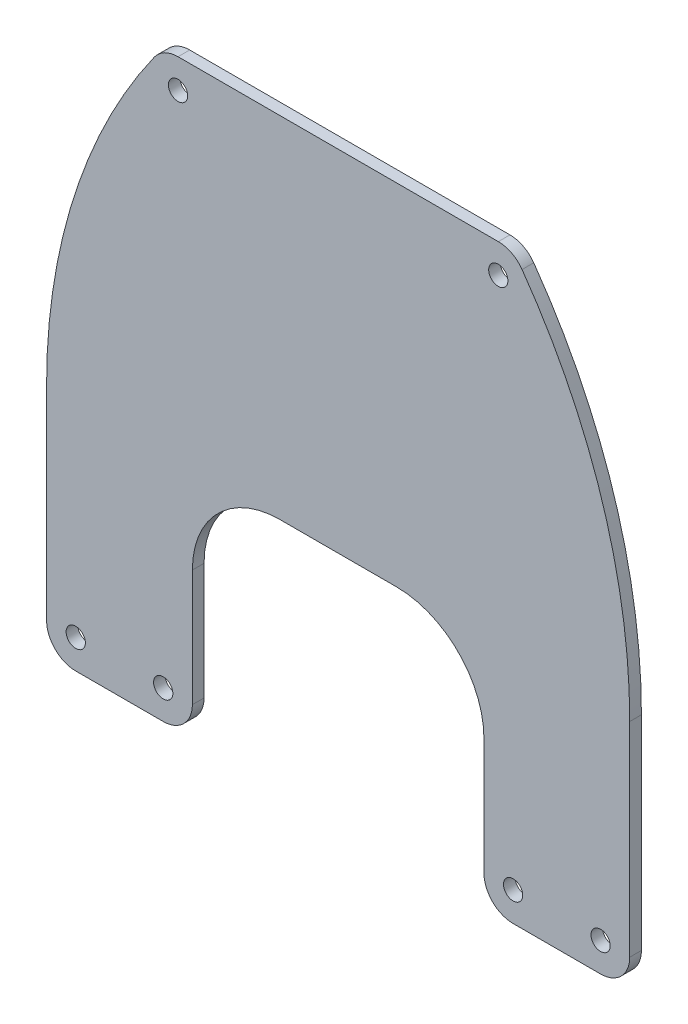
ISO-10303-21;
HEADER;
FILE_DESCRIPTION(('STEP AP214'),'2;1');
FILE_NAME('part.step','',(''),(''),'','','');
FILE_SCHEMA(('AUTOMOTIVE_DESIGN { 1 0 10303 214 1 1 1 1 }'));
ENDSEC;
DATA;
#1=APPLICATION_CONTEXT('core data for automotive mechanical design processes');
#2=APPLICATION_PROTOCOL_DEFINITION('international standard','automotive_design',2000,#1);
#3=PRODUCT_CONTEXT('',#1,'mechanical');
#4=PRODUCT('Part','Part','',(#3));
#5=PRODUCT_RELATED_PRODUCT_CATEGORY('part','',(#4));
#6=PRODUCT_DEFINITION_FORMATION('','',#4);
#7=PRODUCT_DEFINITION_CONTEXT('part definition',#1,'design');
#8=PRODUCT_DEFINITION('design','',#6,#7);
#9=PRODUCT_DEFINITION_SHAPE('','',#8);
#10=(LENGTH_UNIT() NAMED_UNIT(*) SI_UNIT(.MILLI.,.METRE.));
#11=(NAMED_UNIT(*) PLANE_ANGLE_UNIT() SI_UNIT($,.RADIAN.));
#12=(NAMED_UNIT(*) SI_UNIT($,.STERADIAN.) SOLID_ANGLE_UNIT());
#13=UNCERTAINTY_MEASURE_WITH_UNIT(LENGTH_MEASURE(1.E-05),#10,'distance_accuracy_value','');
#14=(GEOMETRIC_REPRESENTATION_CONTEXT(3) GLOBAL_UNCERTAINTY_ASSIGNED_CONTEXT((#13)) GLOBAL_UNIT_ASSIGNED_CONTEXT((#10,
#11,#12)) REPRESENTATION_CONTEXT('',''));
#15=CARTESIAN_POINT('',(0.,0.,0.));
#16=DIRECTION('',(0.,0.,1.));
#17=DIRECTION('',(1.,0.,0.));
#18=AXIS2_PLACEMENT_3D('',#15,#16,#17);
#19=CARTESIAN_POINT('',(0.,40.,2.));
#20=DIRECTION('',(0.,1.,0.));
#21=DIRECTION('',(0.,0.,1.));
#22=AXIS2_PLACEMENT_3D('',#19,#20,#21);
#23=PLANE('',#22);
#24=DIRECTION('',(1.,0.,0.));
#25=VECTOR('',#24,1.);
#26=CARTESIAN_POINT('',(0.,40.,0.));
#27=LINE('',#26,#25);
#28=CARTESIAN_POINT('',(-60.,40.,0.));
#29=VERTEX_POINT('',#28);
#30=CARTESIAN_POINT('',(-40.,40.,0.));
#31=VERTEX_POINT('',#30);
#32=EDGE_CURVE('E200',#29,#31,#27,.T.);
#33=ORIENTED_EDGE('',*,*,#32,.T.);
#34=DIRECTION('',(0.,0.,-1.));
#35=VECTOR('',#34,1.);
#36=CARTESIAN_POINT('',(-40.,40.,2.));
#37=LINE('',#36,#35);
#38=CARTESIAN_POINT('',(-40.,40.,2.));
#39=VERTEX_POINT('',#38);
#40=EDGE_CURVE('E235',#31,#39,#37,.F.);
#41=ORIENTED_EDGE('',*,*,#40,.T.);
#42=DIRECTION('',(1.,0.,0.));
#43=VECTOR('',#42,1.);
#44=CARTESIAN_POINT('',(0.,40.,2.));
#45=LINE('',#44,#43);
#46=CARTESIAN_POINT('',(-60.,40.,2.));
#47=VERTEX_POINT('',#46);
#48=EDGE_CURVE('E227',#47,#39,#45,.T.);
#49=ORIENTED_EDGE('',*,*,#48,.F.);
#50=DIRECTION('',(0.,0.,-1.));
#51=VECTOR('',#50,1.);
#52=CARTESIAN_POINT('',(-60.,40.,2.));
#53=LINE('',#52,#51);
#54=EDGE_CURVE('E232',#47,#29,#53,.T.);
#55=ORIENTED_EDGE('',*,*,#54,.T.);
#56=EDGE_LOOP('',(#33,#41,#49,#55));
#57=FACE_BOUND('',#56,.T.);
#58=ADVANCED_FACE('F35',(#57),#23,.F.);
#59=CARTESIAN_POINT('',(-25.,0.,2.));
#60=DIRECTION('',(1.,0.,0.));
#61=DIRECTION('',(0.,1.,0.));
#62=AXIS2_PLACEMENT_3D('',#59,#60,#61);
#63=PLANE('',#62);
#64=DIRECTION('',(0.,-1.,0.));
#65=VECTOR('',#64,1.);
#66=CARTESIAN_POINT('',(-25.,0.,0.));
#67=LINE('',#66,#65);
#68=CARTESIAN_POINT('',(-25.,25.,0.));
#69=VERTEX_POINT('',#68);
#70=CARTESIAN_POINT('',(-25.,5.,0.));
#71=VERTEX_POINT('',#70);
#72=EDGE_CURVE('E203',#69,#71,#67,.T.);
#73=ORIENTED_EDGE('',*,*,#72,.T.);
#74=DIRECTION('',(0.,0.,-1.));
#75=VECTOR('',#74,1.);
#76=CARTESIAN_POINT('',(-25.,5.,2.));
#77=LINE('',#76,#75);
#78=CARTESIAN_POINT('',(-25.,5.,2.));
#79=VERTEX_POINT('',#78);
#80=EDGE_CURVE('E279',#71,#79,#77,.F.);
#81=ORIENTED_EDGE('',*,*,#80,.T.);
#82=DIRECTION('',(0.,-1.,0.));
#83=VECTOR('',#82,1.);
#84=CARTESIAN_POINT('',(-25.,0.,2.));
#85=LINE('',#84,#83);
#86=CARTESIAN_POINT('',(-25.,25.,2.));
#87=VERTEX_POINT('',#86);
#88=EDGE_CURVE('E349',#87,#79,#85,.T.);
#89=ORIENTED_EDGE('',*,*,#88,.F.);
#90=DIRECTION('',(0.,0.,-1.));
#91=VECTOR('',#90,1.);
#92=CARTESIAN_POINT('',(-25.,25.,0.));
#93=LINE('',#92,#91);
#94=EDGE_CURVE('E181',#87,#69,#93,.T.);
#95=ORIENTED_EDGE('',*,*,#94,.T.);
#96=EDGE_LOOP('',(#73,#81,#89,#95));
#97=FACE_BOUND('',#96,.T.);
#98=ADVANCED_FACE('F346',(#97),#63,.F.);
#99=CARTESIAN_POINT('',(0.,0.,2.));
#100=DIRECTION('',(0.,-1.,0.));
#101=DIRECTION('',(1.,0.,0.));
#102=AXIS2_PLACEMENT_3D('',#99,#100,#101);
#103=PLANE('',#102);
#104=DIRECTION('',(-1.,0.,0.));
#105=VECTOR('',#104,1.);
#106=CARTESIAN_POINT('',(0.,0.,0.));
#107=LINE('',#106,#105);
#108=CARTESIAN_POINT('',(-5.,0.,0.));
#109=VERTEX_POINT('',#108);
#110=CARTESIAN_POINT('',(-20.,0.,0.));
#111=VERTEX_POINT('',#110);
#112=EDGE_CURVE('E207',#109,#111,#107,.T.);
#113=ORIENTED_EDGE('',*,*,#112,.F.);
#114=DIRECTION('',(0.,0.,-1.));
#115=VECTOR('',#114,1.);
#116=CARTESIAN_POINT('',(-5.,0.,2.));
#117=LINE('',#116,#115);
#118=CARTESIAN_POINT('',(-5.,0.,2.));
#119=VERTEX_POINT('',#118);
#120=EDGE_CURVE('E260',#109,#119,#117,.F.);
#121=ORIENTED_EDGE('',*,*,#120,.T.);
#122=DIRECTION('',(-1.,0.,0.));
#123=VECTOR('',#122,1.);
#124=CARTESIAN_POINT('',(0.,0.,2.));
#125=LINE('',#124,#123);
#126=CARTESIAN_POINT('',(-20.,0.,2.));
#127=VERTEX_POINT('',#126);
#128=EDGE_CURVE('E173',#119,#127,#125,.T.);
#129=ORIENTED_EDGE('',*,*,#128,.T.);
#130=DIRECTION('',(0.,0.,-1.));
#131=VECTOR('',#130,1.);
#132=CARTESIAN_POINT('',(-20.,0.,0.));
#133=LINE('',#132,#131);
#134=EDGE_CURVE('E257',#127,#111,#133,.T.);
#135=ORIENTED_EDGE('',*,*,#134,.T.);
#136=EDGE_LOOP('',(#113,#121,#129,#135));
#137=FACE_BOUND('',#136,.T.);
#138=ADVANCED_FACE('F419',(#137),#103,.T.);
#139=CARTESIAN_POINT('',(0.,0.,2.));
#140=DIRECTION('',(-1.,0.,0.));
#141=DIRECTION('',(0.,0.,1.));
#142=AXIS2_PLACEMENT_3D('',#139,#140,#141);
#143=PLANE('',#142);
#144=DIRECTION('',(0.,1.,0.));
#145=VECTOR('',#144,1.);
#146=CARTESIAN_POINT('',(0.,0.,2.));
#147=LINE('',#146,#145);
#148=CARTESIAN_POINT('',(0.,5.,2.));
#149=VERTEX_POINT('',#148);
#150=CARTESIAN_POINT('',(0.,40.,2.));
#151=VERTEX_POINT('',#150);
#152=EDGE_CURVE('E162',#149,#151,#147,.T.);
#153=ORIENTED_EDGE('',*,*,#152,.F.);
#154=DIRECTION('',(0.,0.,-1.));
#155=VECTOR('',#154,1.);
#156=CARTESIAN_POINT('',(0.,5.,0.));
#157=LINE('',#156,#155);
#158=CARTESIAN_POINT('',(0.,5.,0.));
#159=VERTEX_POINT('',#158);
#160=EDGE_CURVE('E247',#149,#159,#157,.T.);
#161=ORIENTED_EDGE('',*,*,#160,.T.);
#162=DIRECTION('',(0.,1.,0.));
#163=VECTOR('',#162,1.);
#164=CARTESIAN_POINT('',(0.,0.,0.));
#165=LINE('',#164,#163);
#166=CARTESIAN_POINT('',(0.,40.,0.));
#167=VERTEX_POINT('',#166);
#168=EDGE_CURVE('E179',#159,#167,#165,.T.);
#169=ORIENTED_EDGE('',*,*,#168,.T.);
#170=DIRECTION('',(0.,0.,-1.));
#171=VECTOR('',#170,1.);
#172=CARTESIAN_POINT('',(0.,40.,2.));
#173=LINE('',#172,#171);
#174=EDGE_CURVE('E176',#151,#167,#173,.T.);
#175=ORIENTED_EDGE('',*,*,#174,.F.);
#176=EDGE_LOOP('',(#153,#161,#169,#175));
#177=FACE_BOUND('',#176,.T.);
#178=ADVANCED_FACE('F177',(#177),#143,.F.);
#179=CARTESIAN_POINT('',(-100.,40.,2.));
#180=DIRECTION('',(0.,0.,-1.));
#181=DIRECTION('',(-1.,0.,0.));
#182=AXIS2_PLACEMENT_3D('',#179,#180,#181);
#183=CYLINDRICAL_SURFACE('',#182,100.);
#184=CARTESIAN_POINT('',(-100.,40.,0.));
#185=DIRECTION('',(0.,0.,1.));
#186=DIRECTION('',(1.,0.,0.));
#187=AXIS2_PLACEMENT_3D('',#184,#185,#186);
#188=CIRCLE('',#187,100.);
#189=CARTESIAN_POINT('',(-18.4635085008965,97.8947368421053,0.));
#190=VERTEX_POINT('',#189);
#191=EDGE_CURVE('E211',#167,#190,#188,.T.);
#192=ORIENTED_EDGE('',*,*,#191,.T.);
#193=DIRECTION('',(0.,0.,-1.));
#194=VECTOR('',#193,1.);
#195=CARTESIAN_POINT('',(-18.4635085008965,97.8947368421053,2.));
#196=LINE('',#195,#194);
#197=CARTESIAN_POINT('',(-18.4635085008965,97.8947368421053,2.));
#198=VERTEX_POINT('',#197);
#199=EDGE_CURVE('E58',#190,#198,#196,.F.);
#200=ORIENTED_EDGE('',*,*,#199,.T.);
#201=CARTESIAN_POINT('',(-100.,40.,2.));
#202=DIRECTION('',(0.,0.,1.));
#203=DIRECTION('',(1.,0.,0.));
#204=AXIS2_PLACEMENT_3D('',#201,#202,#203);
#205=CIRCLE('',#204,100.);
#206=EDGE_CURVE('E165',#151,#198,#205,.T.);
#207=ORIENTED_EDGE('',*,*,#206,.F.);
#208=ORIENTED_EDGE('',*,*,#174,.T.);
#209=EDGE_LOOP('',(#192,#200,#207,#208));
#210=FACE_BOUND('',#209,.T.);
#211=ADVANCED_FACE('F184',(#210),#183,.T.);
#212=CARTESIAN_POINT('',(0.,100.,2.));
#213=DIRECTION('',(0.,-1.,0.));
#214=DIRECTION('',(1.,0.,0.));
#215=AXIS2_PLACEMENT_3D('',#212,#213,#214);
#216=PLANE('',#215);
#217=DIRECTION('',(-1.,0.,0.));
#218=VECTOR('',#217,1.);
#219=CARTESIAN_POINT('',(0.,100.,2.));
#220=LINE('',#219,#218);
#221=CARTESIAN_POINT('',(-22.5403330758517,100.,2.));
#222=VERTEX_POINT('',#221);
#223=CARTESIAN_POINT('',(-77.4596669241483,100.,2.));
#224=VERTEX_POINT('',#223);
#225=EDGE_CURVE('E185',#222,#224,#220,.T.);
#226=ORIENTED_EDGE('',*,*,#225,.F.);
#227=DIRECTION('',(0.,0.,-1.));
#228=VECTOR('',#227,1.);
#229=CARTESIAN_POINT('',(-22.5403330758517,100.,2.));
#230=LINE('',#229,#228);
#231=CARTESIAN_POINT('',(-22.5403330758517,100.,0.));
#232=VERTEX_POINT('',#231);
#233=EDGE_CURVE('E283',#222,#232,#230,.T.);
#234=ORIENTED_EDGE('',*,*,#233,.T.);
#235=DIRECTION('',(-1.,0.,0.));
#236=VECTOR('',#235,1.);
#237=CARTESIAN_POINT('',(0.,100.,0.));
#238=LINE('',#237,#236);
#239=CARTESIAN_POINT('',(-77.4596669241483,100.,0.));
#240=VERTEX_POINT('',#239);
#241=EDGE_CURVE('E213',#232,#240,#238,.T.);
#242=ORIENTED_EDGE('',*,*,#241,.T.);
#243=DIRECTION('',(0.,0.,1.));
#244=VECTOR('',#243,1.);
#245=CARTESIAN_POINT('',(-77.4596669241483,100.,2.));
#246=LINE('',#245,#244);
#247=EDGE_CURVE('E281',#240,#224,#246,.T.);
#248=ORIENTED_EDGE('',*,*,#247,.T.);
#249=EDGE_LOOP('',(#226,#234,#242,#248));
#250=FACE_BOUND('',#249,.T.);
#251=ADVANCED_FACE('F295',(#250),#216,.F.);
#252=CARTESIAN_POINT('',(0.,40.,2.));
#253=DIRECTION('',(0.,0.,-1.));
#254=DIRECTION('',(-1.,0.,0.));
#255=AXIS2_PLACEMENT_3D('',#252,#253,#254);
#256=CYLINDRICAL_SURFACE('',#255,100.);
#257=CARTESIAN_POINT('',(0.,40.,2.));
#258=DIRECTION('',(0.,0.,1.));
#259=DIRECTION('',(1.,0.,0.));
#260=AXIS2_PLACEMENT_3D('',#257,#258,#259);
#261=CIRCLE('',#260,100.);
#262=CARTESIAN_POINT('',(-100.,40.,2.));
#263=VERTEX_POINT('',#262);
#264=CARTESIAN_POINT('',(-81.5364914991035,97.8947368421053,2.));
#265=VERTEX_POINT('',#264);
#266=EDGE_CURVE('E187',#263,#265,#261,.F.);
#267=ORIENTED_EDGE('',*,*,#266,.T.);
#268=DIRECTION('',(0.,0.,-1.));
#269=VECTOR('',#268,1.);
#270=CARTESIAN_POINT('',(-81.5364914991035,97.8947368421053,2.));
#271=LINE('',#270,#269);
#272=CARTESIAN_POINT('',(-81.5364914991035,97.8947368421053,0.));
#273=VERTEX_POINT('',#272);
#274=EDGE_CURVE('E11',#265,#273,#271,.T.);
#275=ORIENTED_EDGE('',*,*,#274,.T.);
#276=CARTESIAN_POINT('',(0.,40.,0.));
#277=DIRECTION('',(0.,0.,1.));
#278=DIRECTION('',(1.,0.,0.));
#279=AXIS2_PLACEMENT_3D('',#276,#277,#278);
#280=CIRCLE('',#279,100.);
#281=CARTESIAN_POINT('',(-100.,40.,0.));
#282=VERTEX_POINT('',#281);
#283=EDGE_CURVE('E216',#282,#273,#280,.F.);
#284=ORIENTED_EDGE('',*,*,#283,.F.);
#285=DIRECTION('',(0.,0.,-1.));
#286=VECTOR('',#285,1.);
#287=CARTESIAN_POINT('',(-100.,40.,2.));
#288=LINE('',#287,#286);
#289=EDGE_CURVE('E182',#263,#282,#288,.T.);
#290=ORIENTED_EDGE('',*,*,#289,.F.);
#291=EDGE_LOOP('',(#267,#275,#284,#290));
#292=FACE_BOUND('',#291,.T.);
#293=ADVANCED_FACE('F305',(#292),#256,.T.);
#294=CARTESIAN_POINT('',(-100.,0.,2.));
#295=DIRECTION('',(-1.,0.,0.));
#296=DIRECTION('',(0.,0.,1.));
#297=AXIS2_PLACEMENT_3D('',#294,#295,#296);
#298=PLANE('',#297);
#299=DIRECTION('',(0.,1.,0.));
#300=VECTOR('',#299,1.);
#301=CARTESIAN_POINT('',(-100.,0.,0.));
#302=LINE('',#301,#300);
#303=CARTESIAN_POINT('',(-100.,4.99999999999999,0.));
#304=VERTEX_POINT('',#303);
#305=EDGE_CURVE('E219',#304,#282,#302,.T.);
#306=ORIENTED_EDGE('',*,*,#305,.F.);
#307=DIRECTION('',(0.,0.,-1.));
#308=VECTOR('',#307,1.);
#309=CARTESIAN_POINT('',(-100.,4.99999999999999,2.));
#310=LINE('',#309,#308);
#311=CARTESIAN_POINT('',(-100.,4.99999999999999,2.));
#312=VERTEX_POINT('',#311);
#313=EDGE_CURVE('E274',#304,#312,#310,.F.);
#314=ORIENTED_EDGE('',*,*,#313,.T.);
#315=DIRECTION('',(0.,1.,0.));
#316=VECTOR('',#315,1.);
#317=CARTESIAN_POINT('',(-100.,0.,2.));
#318=LINE('',#317,#316);
#319=EDGE_CURVE('E192',#312,#263,#318,.T.);
#320=ORIENTED_EDGE('',*,*,#319,.T.);
#321=ORIENTED_EDGE('',*,*,#289,.T.);
#322=EDGE_LOOP('',(#306,#314,#320,#321));
#323=FACE_BOUND('',#322,.T.);
#324=ADVANCED_FACE('F310',(#323),#298,.T.);
#325=CARTESIAN_POINT('',(0.,0.,2.));
#326=DIRECTION('',(0.,-1.,0.));
#327=DIRECTION('',(1.,0.,0.));
#328=AXIS2_PLACEMENT_3D('',#325,#326,#327);
#329=PLANE('',#328);
#330=DIRECTION('',(-1.,0.,0.));
#331=VECTOR('',#330,1.);
#332=CARTESIAN_POINT('',(0.,0.,2.));
#333=LINE('',#332,#331);
#334=CARTESIAN_POINT('',(-80.,0.,2.));
#335=VERTEX_POINT('',#334);
#336=CARTESIAN_POINT('',(-95.,0.,2.));
#337=VERTEX_POINT('',#336);
#338=EDGE_CURVE('E194',#335,#337,#333,.T.);
#339=ORIENTED_EDGE('',*,*,#338,.T.);
#340=DIRECTION('',(0.,0.,-1.));
#341=VECTOR('',#340,1.);
#342=CARTESIAN_POINT('',(-95.,0.,2.));
#343=LINE('',#342,#341);
#344=CARTESIAN_POINT('',(-95.,0.,0.));
#345=VERTEX_POINT('',#344);
#346=EDGE_CURVE('E271',#337,#345,#343,.T.);
#347=ORIENTED_EDGE('',*,*,#346,.T.);
#348=DIRECTION('',(-1.,0.,0.));
#349=VECTOR('',#348,1.);
#350=CARTESIAN_POINT('',(0.,0.,0.));
#351=LINE('',#350,#349);
#352=CARTESIAN_POINT('',(-80.,0.,0.));
#353=VERTEX_POINT('',#352);
#354=EDGE_CURVE('E221',#353,#345,#351,.T.);
#355=ORIENTED_EDGE('',*,*,#354,.F.);
#356=DIRECTION('',(0.,0.,-1.));
#357=VECTOR('',#356,1.);
#358=CARTESIAN_POINT('',(-80.,0.,2.));
#359=LINE('',#358,#357);
#360=EDGE_CURVE('E269',#353,#335,#359,.F.);
#361=ORIENTED_EDGE('',*,*,#360,.T.);
#362=EDGE_LOOP('',(#339,#347,#355,#361));
#363=FACE_BOUND('',#362,.T.);
#364=ADVANCED_FACE('F319',(#363),#329,.T.);
#365=CARTESIAN_POINT('',(-75.,0.,2.));
#366=DIRECTION('',(1.,0.,0.));
#367=DIRECTION('',(0.,0.,-1.));
#368=AXIS2_PLACEMENT_3D('',#365,#366,#367);
#369=PLANE('',#368);
#370=DIRECTION('',(0.,-1.,0.));
#371=VECTOR('',#370,1.);
#372=CARTESIAN_POINT('',(-75.,0.,2.));
#373=LINE('',#372,#371);
#374=CARTESIAN_POINT('',(-75.,25.,2.));
#375=VERTEX_POINT('',#374);
#376=CARTESIAN_POINT('',(-75.,4.99999999999999,2.));
#377=VERTEX_POINT('',#376);
#378=EDGE_CURVE('E197',#375,#377,#373,.T.);
#379=ORIENTED_EDGE('',*,*,#378,.T.);
#380=DIRECTION('',(0.,0.,-1.));
#381=VECTOR('',#380,1.);
#382=CARTESIAN_POINT('',(-75.,4.99999999999999,2.));
#383=LINE('',#382,#381);
#384=CARTESIAN_POINT('',(-75.,4.99999999999999,0.));
#385=VERTEX_POINT('',#384);
#386=EDGE_CURVE('E276',#377,#385,#383,.T.);
#387=ORIENTED_EDGE('',*,*,#386,.T.);
#388=DIRECTION('',(0.,-1.,0.));
#389=VECTOR('',#388,1.);
#390=CARTESIAN_POINT('',(-75.,0.,0.));
#391=LINE('',#390,#389);
#392=CARTESIAN_POINT('',(-75.,25.,0.));
#393=VERTEX_POINT('',#392);
#394=EDGE_CURVE('E224',#393,#385,#391,.T.);
#395=ORIENTED_EDGE('',*,*,#394,.F.);
#396=DIRECTION('',(0.,0.,-1.));
#397=VECTOR('',#396,1.);
#398=CARTESIAN_POINT('',(-75.,25.,2.));
#399=LINE('',#398,#397);
#400=EDGE_CURVE('E237',#393,#375,#399,.F.);
#401=ORIENTED_EDGE('',*,*,#400,.T.);
#402=EDGE_LOOP('',(#379,#387,#395,#401));
#403=FACE_BOUND('',#402,.T.);
#404=ADVANCED_FACE('F327',(#403),#369,.T.);
#405=CARTESIAN_POINT('',(0.,0.,2.));
#406=DIRECTION('',(0.,0.,1.));
#407=DIRECTION('',(1.,0.,0.));
#408=AXIS2_PLACEMENT_3D('',#405,#406,#407);
#409=PLANE('',#408);
#410=CARTESIAN_POINT('',(-5.,5.,2.));
#411=DIRECTION('',(0.,0.,1.));
#412=DIRECTION('',(1.,0.,0.));
#413=AXIS2_PLACEMENT_3D('',#410,#411,#412);
#414=CIRCLE('',#413,1.65);
#415=CARTESIAN_POINT('',(-3.35,5.,2.));
#416=VERTEX_POINT('',#415);
#417=EDGE_CURVE('E364',#416,#416,#414,.T.);
#418=ORIENTED_EDGE('',*,*,#417,.F.);
#419=EDGE_LOOP('',(#418));
#420=FACE_BOUND('',#419,.T.);
#421=CARTESIAN_POINT('',(-22.5403330758517,95.,2.));
#422=DIRECTION('',(0.,0.,1.));
#423=DIRECTION('',(1.,0.,0.));
#424=AXIS2_PLACEMENT_3D('',#421,#422,#423);
#425=CIRCLE('',#424,1.65);
#426=CARTESIAN_POINT('',(-20.8903330758517,95.,2.));
#427=VERTEX_POINT('',#426);
#428=EDGE_CURVE('E358',#427,#427,#425,.T.);
#429=ORIENTED_EDGE('',*,*,#428,.F.);
#430=EDGE_LOOP('',(#429));
#431=FACE_BOUND('',#430,.T.);
#432=CARTESIAN_POINT('',(-95.,4.99999999999999,2.));
#433=DIRECTION('',(0.,0.,1.));
#434=DIRECTION('',(1.,0.,0.));
#435=AXIS2_PLACEMENT_3D('',#432,#433,#434);
#436=CIRCLE('',#435,1.65);
#437=CARTESIAN_POINT('',(-93.35,4.99999999999999,2.));
#438=VERTEX_POINT('',#437);
#439=EDGE_CURVE('E371',#438,#438,#436,.T.);
#440=ORIENTED_EDGE('',*,*,#439,.F.);
#441=EDGE_LOOP('',(#440));
#442=FACE_BOUND('',#441,.T.);
#443=CARTESIAN_POINT('',(-80.,4.99999999999999,2.));
#444=DIRECTION('',(0.,0.,1.));
#445=DIRECTION('',(1.,0.,0.));
#446=AXIS2_PLACEMENT_3D('',#443,#444,#445);
#447=CIRCLE('',#446,1.65);
#448=CARTESIAN_POINT('',(-78.35,4.99999999999999,2.));
#449=VERTEX_POINT('',#448);
#450=EDGE_CURVE('E372',#449,#449,#447,.T.);
#451=ORIENTED_EDGE('',*,*,#450,.F.);
#452=EDGE_LOOP('',(#451));
#453=FACE_BOUND('',#452,.T.);
#454=CARTESIAN_POINT('',(-20.,5.,2.));
#455=DIRECTION('',(0.,0.,1.));
#456=DIRECTION('',(1.,0.,0.));
#457=AXIS2_PLACEMENT_3D('',#454,#455,#456);
#458=CIRCLE('',#457,1.65);
#459=CARTESIAN_POINT('',(-18.35,5.,2.));
#460=VERTEX_POINT('',#459);
#461=EDGE_CURVE('E382',#460,#460,#458,.T.);
#462=ORIENTED_EDGE('',*,*,#461,.F.);
#463=EDGE_LOOP('',(#462));
#464=FACE_BOUND('',#463,.T.);
#465=CARTESIAN_POINT('',(-77.4596669241483,95.,2.));
#466=DIRECTION('',(0.,0.,1.));
#467=DIRECTION('',(1.,0.,0.));
#468=AXIS2_PLACEMENT_3D('',#465,#466,#467);
#469=CIRCLE('',#468,1.65);
#470=CARTESIAN_POINT('',(-75.8096669241483,95.,2.));
#471=VERTEX_POINT('',#470);
#472=EDGE_CURVE('E355',#471,#471,#469,.T.);
#473=ORIENTED_EDGE('',*,*,#472,.F.);
#474=EDGE_LOOP('',(#473));
#475=FACE_BOUND('',#474,.T.);
#476=ORIENTED_EDGE('',*,*,#206,.T.);
#477=CARTESIAN_POINT('',(-22.5403330758517,95.,2.));
#478=DIRECTION('',(0.,0.,1.));
#479=DIRECTION('',(1.,0.,0.));
#480=AXIS2_PLACEMENT_3D('',#477,#478,#479);
#481=CIRCLE('',#480,5.);
#482=EDGE_CURVE('E43',#198,#222,#481,.T.);
#483=ORIENTED_EDGE('',*,*,#482,.T.);
#484=ORIENTED_EDGE('',*,*,#225,.T.);
#485=CARTESIAN_POINT('',(-77.4596669241483,95.,2.));
#486=DIRECTION('',(0.,0.,1.));
#487=DIRECTION('',(1.,0.,0.));
#488=AXIS2_PLACEMENT_3D('',#485,#486,#487);
#489=CIRCLE('',#488,5.);
#490=EDGE_CURVE('E50',#224,#265,#489,.T.);
#491=ORIENTED_EDGE('',*,*,#490,.T.);
#492=ORIENTED_EDGE('',*,*,#266,.F.);
#493=ORIENTED_EDGE('',*,*,#319,.F.);
#494=CARTESIAN_POINT('',(-95.,4.99999999999999,2.));
#495=DIRECTION('',(0.,0.,1.));
#496=DIRECTION('',(1.,0.,0.));
#497=AXIS2_PLACEMENT_3D('',#494,#495,#496);
#498=CIRCLE('',#497,5.);
#499=EDGE_CURVE('E266',#312,#337,#498,.T.);
#500=ORIENTED_EDGE('',*,*,#499,.T.);
#501=ORIENTED_EDGE('',*,*,#338,.F.);
#502=CARTESIAN_POINT('',(-80.,4.99999999999999,2.));
#503=DIRECTION('',(0.,0.,1.));
#504=DIRECTION('',(1.,0.,0.));
#505=AXIS2_PLACEMENT_3D('',#502,#503,#504);
#506=CIRCLE('',#505,5.);
#507=EDGE_CURVE('E264',#335,#377,#506,.T.);
#508=ORIENTED_EDGE('',*,*,#507,.T.);
#509=ORIENTED_EDGE('',*,*,#378,.F.);
#510=CARTESIAN_POINT('',(-60.,25.,2.));
#511=DIRECTION('',(0.,0.,1.));
#512=DIRECTION('',(1.,0.,0.));
#513=AXIS2_PLACEMENT_3D('',#510,#511,#512);
#514=CIRCLE('',#513,15.);
#515=EDGE_CURVE('E245',#375,#47,#514,.F.);
#516=ORIENTED_EDGE('',*,*,#515,.T.);
#517=ORIENTED_EDGE('',*,*,#48,.T.);
#518=CARTESIAN_POINT('',(-40.,25.,2.));
#519=DIRECTION('',(0.,0.,1.));
#520=DIRECTION('',(1.,0.,0.));
#521=AXIS2_PLACEMENT_3D('',#518,#519,#520);
#522=CIRCLE('',#521,15.);
#523=EDGE_CURVE('E241',#39,#87,#522,.F.);
#524=ORIENTED_EDGE('',*,*,#523,.T.);
#525=ORIENTED_EDGE('',*,*,#88,.T.);
#526=CARTESIAN_POINT('',(-20.,5.,2.));
#527=DIRECTION('',(0.,0.,1.));
#528=DIRECTION('',(1.,0.,0.));
#529=AXIS2_PLACEMENT_3D('',#526,#527,#528);
#530=CIRCLE('',#529,5.);
#531=EDGE_CURVE('E262',#79,#127,#530,.T.);
#532=ORIENTED_EDGE('',*,*,#531,.T.);
#533=ORIENTED_EDGE('',*,*,#128,.F.);
#534=CARTESIAN_POINT('',(-5.,5.,2.));
#535=DIRECTION('',(0.,0.,1.));
#536=DIRECTION('',(1.,0.,0.));
#537=AXIS2_PLACEMENT_3D('',#534,#535,#536);
#538=CIRCLE('',#537,5.);
#539=EDGE_CURVE('E169',#119,#149,#538,.T.);
#540=ORIENTED_EDGE('',*,*,#539,.T.);
#541=ORIENTED_EDGE('',*,*,#152,.T.);
#542=EDGE_LOOP('',(#476,#483,#484,#491,#492,#493,#500,#501,#508,#509,#516,#517,#524,#525,#532,
#533,#540,#541));
#543=FACE_BOUND('',#542,.T.);
#544=ADVANCED_FACE('F164',(#420,#431,#442,#453,#464,#475,#543),#409,.T.);
#545=CARTESIAN_POINT('',(0.,0.,0.));
#546=DIRECTION('',(0.,0.,1.));
#547=DIRECTION('',(1.,0.,0.));
#548=AXIS2_PLACEMENT_3D('',#545,#546,#547);
#549=PLANE('',#548);
#550=CARTESIAN_POINT('',(-5.,5.,0.));
#551=DIRECTION('',(0.,0.,1.));
#552=DIRECTION('',(1.,0.,0.));
#553=AXIS2_PLACEMENT_3D('',#550,#551,#552);
#554=CIRCLE('',#553,1.65);
#555=CARTESIAN_POINT('',(-3.35,5.,0.));
#556=VERTEX_POINT('',#555);
#557=EDGE_CURVE('E361',#556,#556,#554,.T.);
#558=ORIENTED_EDGE('',*,*,#557,.T.);
#559=EDGE_LOOP('',(#558));
#560=FACE_BOUND('',#559,.T.);
#561=CARTESIAN_POINT('',(-22.5403330758517,95.,0.));
#562=DIRECTION('',(0.,0.,1.));
#563=DIRECTION('',(1.,0.,0.));
#564=AXIS2_PLACEMENT_3D('',#561,#562,#563);
#565=CIRCLE('',#564,1.65);
#566=CARTESIAN_POINT('',(-20.8903330758517,95.,0.));
#567=VERTEX_POINT('',#566);
#568=EDGE_CURVE('E375',#567,#567,#565,.T.);
#569=ORIENTED_EDGE('',*,*,#568,.T.);
#570=EDGE_LOOP('',(#569));
#571=FACE_BOUND('',#570,.T.);
#572=CARTESIAN_POINT('',(-95.,4.99999999999999,0.));
#573=DIRECTION('',(0.,0.,1.));
#574=DIRECTION('',(1.,0.,0.));
#575=AXIS2_PLACEMENT_3D('',#572,#573,#574);
#576=CIRCLE('',#575,1.65);
#577=CARTESIAN_POINT('',(-93.35,4.99999999999999,0.));
#578=VERTEX_POINT('',#577);
#579=EDGE_CURVE('E368',#578,#578,#576,.T.);
#580=ORIENTED_EDGE('',*,*,#579,.T.);
#581=EDGE_LOOP('',(#580));
#582=FACE_BOUND('',#581,.T.);
#583=CARTESIAN_POINT('',(-80.,4.99999999999999,0.));
#584=DIRECTION('',(0.,0.,1.));
#585=DIRECTION('',(1.,0.,0.));
#586=AXIS2_PLACEMENT_3D('',#583,#584,#585);
#587=CIRCLE('',#586,1.65);
#588=CARTESIAN_POINT('',(-78.35,4.99999999999999,0.));
#589=VERTEX_POINT('',#588);
#590=EDGE_CURVE('E385',#589,#589,#587,.T.);
#591=ORIENTED_EDGE('',*,*,#590,.T.);
#592=EDGE_LOOP('',(#591));
#593=FACE_BOUND('',#592,.T.);
#594=CARTESIAN_POINT('',(-20.,5.,0.));
#595=DIRECTION('',(0.,0.,1.));
#596=DIRECTION('',(1.,0.,0.));
#597=AXIS2_PLACEMENT_3D('',#594,#595,#596);
#598=CIRCLE('',#597,1.65);
#599=CARTESIAN_POINT('',(-18.35,5.,0.));
#600=VERTEX_POINT('',#599);
#601=EDGE_CURVE('E367',#600,#600,#598,.T.);
#602=ORIENTED_EDGE('',*,*,#601,.T.);
#603=EDGE_LOOP('',(#602));
#604=FACE_BOUND('',#603,.T.);
#605=CARTESIAN_POINT('',(-77.4596669241483,95.,0.));
#606=DIRECTION('',(0.,0.,1.));
#607=DIRECTION('',(1.,0.,0.));
#608=AXIS2_PLACEMENT_3D('',#605,#606,#607);
#609=CIRCLE('',#608,1.65);
#610=CARTESIAN_POINT('',(-75.8096669241483,95.,0.));
#611=VERTEX_POINT('',#610);
#612=EDGE_CURVE('E204',#611,#611,#609,.T.);
#613=ORIENTED_EDGE('',*,*,#612,.T.);
#614=EDGE_LOOP('',(#613));
#615=FACE_BOUND('',#614,.T.);
#616=ORIENTED_EDGE('',*,*,#241,.F.);
#617=CARTESIAN_POINT('',(-22.5403330758517,95.,0.));
#618=DIRECTION('',(0.,0.,1.));
#619=DIRECTION('',(1.,0.,0.));
#620=AXIS2_PLACEMENT_3D('',#617,#618,#619);
#621=CIRCLE('',#620,5.);
#622=EDGE_CURVE('E288',#232,#190,#621,.F.);
#623=ORIENTED_EDGE('',*,*,#622,.T.);
#624=ORIENTED_EDGE('',*,*,#191,.F.);
#625=ORIENTED_EDGE('',*,*,#168,.F.);
#626=CARTESIAN_POINT('',(-5.,5.,0.));
#627=DIRECTION('',(0.,0.,1.));
#628=DIRECTION('',(1.,0.,0.));
#629=AXIS2_PLACEMENT_3D('',#626,#627,#628);
#630=CIRCLE('',#629,5.);
#631=EDGE_CURVE('E255',#159,#109,#630,.F.);
#632=ORIENTED_EDGE('',*,*,#631,.T.);
#633=ORIENTED_EDGE('',*,*,#112,.T.);
#634=CARTESIAN_POINT('',(-20.,5.,0.));
#635=DIRECTION('',(0.,0.,1.));
#636=DIRECTION('',(1.,0.,0.));
#637=AXIS2_PLACEMENT_3D('',#634,#635,#636);
#638=CIRCLE('',#637,5.);
#639=EDGE_CURVE('E249',#111,#71,#638,.F.);
#640=ORIENTED_EDGE('',*,*,#639,.T.);
#641=ORIENTED_EDGE('',*,*,#72,.F.);
#642=CARTESIAN_POINT('',(-40.,25.,0.));
#643=DIRECTION('',(0.,0.,1.));
#644=DIRECTION('',(1.,0.,0.));
#645=AXIS2_PLACEMENT_3D('',#642,#643,#644);
#646=CIRCLE('',#645,15.);
#647=EDGE_CURVE('E239',#69,#31,#646,.T.);
#648=ORIENTED_EDGE('',*,*,#647,.T.);
#649=ORIENTED_EDGE('',*,*,#32,.F.);
#650=CARTESIAN_POINT('',(-60.,25.,0.));
#651=DIRECTION('',(0.,0.,1.));
#652=DIRECTION('',(1.,0.,0.));
#653=AXIS2_PLACEMENT_3D('',#650,#651,#652);
#654=CIRCLE('',#653,15.);
#655=EDGE_CURVE('E243',#29,#393,#654,.T.);
#656=ORIENTED_EDGE('',*,*,#655,.T.);
#657=ORIENTED_EDGE('',*,*,#394,.T.);
#658=CARTESIAN_POINT('',(-80.,4.99999999999999,0.));
#659=DIRECTION('',(0.,0.,1.));
#660=DIRECTION('',(1.,0.,0.));
#661=AXIS2_PLACEMENT_3D('',#658,#659,#660);
#662=CIRCLE('',#661,5.);
#663=EDGE_CURVE('E251',#385,#353,#662,.F.);
#664=ORIENTED_EDGE('',*,*,#663,.T.);
#665=ORIENTED_EDGE('',*,*,#354,.T.);
#666=CARTESIAN_POINT('',(-95.,4.99999999999999,0.));
#667=DIRECTION('',(0.,0.,1.));
#668=DIRECTION('',(1.,0.,0.));
#669=AXIS2_PLACEMENT_3D('',#666,#667,#668);
#670=CIRCLE('',#669,5.);
#671=EDGE_CURVE('E253',#345,#304,#670,.F.);
#672=ORIENTED_EDGE('',*,*,#671,.T.);
#673=ORIENTED_EDGE('',*,*,#305,.T.);
#674=ORIENTED_EDGE('',*,*,#283,.T.);
#675=CARTESIAN_POINT('',(-77.4596669241483,95.,0.));
#676=DIRECTION('',(0.,0.,1.));
#677=DIRECTION('',(1.,0.,0.));
#678=AXIS2_PLACEMENT_3D('',#675,#676,#677);
#679=CIRCLE('',#678,5.);
#680=EDGE_CURVE('E286',#273,#240,#679,.F.);
#681=ORIENTED_EDGE('',*,*,#680,.T.);
#682=EDGE_LOOP('',(#616,#623,#624,#625,#632,#633,#640,#641,#648,#649,#656,#657,#664,#665,#672,
#673,#674,#681));
#683=FACE_BOUND('',#682,.T.);
#684=ADVANCED_FACE('F300',(#560,#571,#582,#593,#604,#615,#683),#549,.F.);
#685=CARTESIAN_POINT('',(-40.,25.,2.));
#686=DIRECTION('',(0.,0.,1.));
#687=DIRECTION('',(1.,0.,0.));
#688=AXIS2_PLACEMENT_3D('',#685,#686,#687);
#689=CYLINDRICAL_SURFACE('',#688,15.);
#690=ORIENTED_EDGE('',*,*,#523,.F.);
#691=ORIENTED_EDGE('',*,*,#40,.F.);
#692=ORIENTED_EDGE('',*,*,#647,.F.);
#693=ORIENTED_EDGE('',*,*,#94,.F.);
#694=EDGE_LOOP('',(#690,#691,#692,#693));
#695=FACE_BOUND('',#694,.T.);
#696=ADVANCED_FACE('F343',(#695),#689,.F.);
#697=CARTESIAN_POINT('',(-60.,25.,2.));
#698=DIRECTION('',(0.,0.,-1.));
#699=DIRECTION('',(-1.,0.,0.));
#700=AXIS2_PLACEMENT_3D('',#697,#698,#699);
#701=CYLINDRICAL_SURFACE('',#700,15.);
#702=ORIENTED_EDGE('',*,*,#515,.F.);
#703=ORIENTED_EDGE('',*,*,#400,.F.);
#704=ORIENTED_EDGE('',*,*,#655,.F.);
#705=ORIENTED_EDGE('',*,*,#54,.F.);
#706=EDGE_LOOP('',(#702,#703,#704,#705));
#707=FACE_BOUND('',#706,.T.);
#708=ADVANCED_FACE('F335',(#707),#701,.F.);
#709=CARTESIAN_POINT('',(-5.,5.,2.));
#710=DIRECTION('',(0.,0.,1.));
#711=DIRECTION('',(1.,0.,0.));
#712=AXIS2_PLACEMENT_3D('',#709,#710,#711);
#713=CYLINDRICAL_SURFACE('',#712,5.);
#714=ORIENTED_EDGE('',*,*,#539,.F.);
#715=ORIENTED_EDGE('',*,*,#120,.F.);
#716=ORIENTED_EDGE('',*,*,#631,.F.);
#717=ORIENTED_EDGE('',*,*,#160,.F.);
#718=EDGE_LOOP('',(#714,#715,#716,#717));
#719=FACE_BOUND('',#718,.T.);
#720=ADVANCED_FACE('F427',(#719),#713,.T.);
#721=CARTESIAN_POINT('',(-95.,4.99999999999999,2.));
#722=DIRECTION('',(0.,0.,-1.));
#723=DIRECTION('',(-1.,0.,0.));
#724=AXIS2_PLACEMENT_3D('',#721,#722,#723);
#725=CYLINDRICAL_SURFACE('',#724,5.);
#726=ORIENTED_EDGE('',*,*,#499,.F.);
#727=ORIENTED_EDGE('',*,*,#313,.F.);
#728=ORIENTED_EDGE('',*,*,#671,.F.);
#729=ORIENTED_EDGE('',*,*,#346,.F.);
#730=EDGE_LOOP('',(#726,#727,#728,#729));
#731=FACE_BOUND('',#730,.T.);
#732=ADVANCED_FACE('F316',(#731),#725,.T.);
#733=CARTESIAN_POINT('',(-80.,4.99999999999999,2.));
#734=DIRECTION('',(0.,0.,-1.));
#735=DIRECTION('',(-1.,0.,0.));
#736=AXIS2_PLACEMENT_3D('',#733,#734,#735);
#737=CYLINDRICAL_SURFACE('',#736,5.);
#738=ORIENTED_EDGE('',*,*,#507,.F.);
#739=ORIENTED_EDGE('',*,*,#360,.F.);
#740=ORIENTED_EDGE('',*,*,#663,.F.);
#741=ORIENTED_EDGE('',*,*,#386,.F.);
#742=EDGE_LOOP('',(#738,#739,#740,#741));
#743=FACE_BOUND('',#742,.T.);
#744=ADVANCED_FACE('F325',(#743),#737,.T.);
#745=CARTESIAN_POINT('',(-20.,5.,2.));
#746=DIRECTION('',(0.,0.,1.));
#747=DIRECTION('',(1.,0.,0.));
#748=AXIS2_PLACEMENT_3D('',#745,#746,#747);
#749=CYLINDRICAL_SURFACE('',#748,5.);
#750=ORIENTED_EDGE('',*,*,#531,.F.);
#751=ORIENTED_EDGE('',*,*,#80,.F.);
#752=ORIENTED_EDGE('',*,*,#639,.F.);
#753=ORIENTED_EDGE('',*,*,#134,.F.);
#754=EDGE_LOOP('',(#750,#751,#752,#753));
#755=FACE_BOUND('',#754,.T.);
#756=ADVANCED_FACE('F435',(#755),#749,.T.);
#757=CARTESIAN_POINT('',(-22.5403330758517,95.,2.));
#758=DIRECTION('',(0.,0.,-1.));
#759=DIRECTION('',(-1.,0.,0.));
#760=AXIS2_PLACEMENT_3D('',#757,#758,#759);
#761=CYLINDRICAL_SURFACE('',#760,5.);
#762=ORIENTED_EDGE('',*,*,#482,.F.);
#763=ORIENTED_EDGE('',*,*,#199,.F.);
#764=ORIENTED_EDGE('',*,*,#622,.F.);
#765=ORIENTED_EDGE('',*,*,#233,.F.);
#766=EDGE_LOOP('',(#762,#763,#764,#765));
#767=FACE_BOUND('',#766,.T.);
#768=ADVANCED_FACE('F298',(#767),#761,.T.);
#769=CARTESIAN_POINT('',(-77.4596669241483,95.,2.));
#770=DIRECTION('',(0.,0.,-1.));
#771=DIRECTION('',(-1.,0.,0.));
#772=AXIS2_PLACEMENT_3D('',#769,#770,#771);
#773=CYLINDRICAL_SURFACE('',#772,5.);
#774=ORIENTED_EDGE('',*,*,#490,.F.);
#775=ORIENTED_EDGE('',*,*,#247,.F.);
#776=ORIENTED_EDGE('',*,*,#680,.F.);
#777=ORIENTED_EDGE('',*,*,#274,.F.);
#778=EDGE_LOOP('',(#774,#775,#776,#777));
#779=FACE_BOUND('',#778,.T.);
#780=ADVANCED_FACE('F37',(#779),#773,.T.);
#781=CARTESIAN_POINT('',(-77.4596669241483,95.,0.));
#782=DIRECTION('',(0.,0.,1.));
#783=DIRECTION('',(1.,0.,0.));
#784=AXIS2_PLACEMENT_3D('',#781,#782,#783);
#785=CYLINDRICAL_SURFACE('',#784,1.65);
#786=ORIENTED_EDGE('',*,*,#612,.F.);
#787=EDGE_LOOP('',(#786));
#788=FACE_BOUND('',#787,.T.);
#789=ORIENTED_EDGE('',*,*,#472,.T.);
#790=EDGE_LOOP('',(#789));
#791=FACE_BOUND('',#790,.T.);
#792=ADVANCED_FACE('F401',(#788,#791),#785,.F.);
#793=CARTESIAN_POINT('',(-20.,5.,0.));
#794=DIRECTION('',(0.,0.,1.));
#795=DIRECTION('',(1.,0.,0.));
#796=AXIS2_PLACEMENT_3D('',#793,#794,#795);
#797=CYLINDRICAL_SURFACE('',#796,1.65);
#798=ORIENTED_EDGE('',*,*,#601,.F.);
#799=EDGE_LOOP('',(#798));
#800=FACE_BOUND('',#799,.T.);
#801=ORIENTED_EDGE('',*,*,#461,.T.);
#802=EDGE_LOOP('',(#801));
#803=FACE_BOUND('',#802,.T.);
#804=ADVANCED_FACE('F403',(#800,#803),#797,.F.);
#805=CARTESIAN_POINT('',(-80.,4.99999999999999,0.));
#806=DIRECTION('',(0.,0.,1.));
#807=DIRECTION('',(1.,0.,0.));
#808=AXIS2_PLACEMENT_3D('',#805,#806,#807);
#809=CYLINDRICAL_SURFACE('',#808,1.65);
#810=ORIENTED_EDGE('',*,*,#590,.F.);
#811=EDGE_LOOP('',(#810));
#812=FACE_BOUND('',#811,.T.);
#813=ORIENTED_EDGE('',*,*,#450,.T.);
#814=EDGE_LOOP('',(#813));
#815=FACE_BOUND('',#814,.T.);
#816=ADVANCED_FACE('F391',(#812,#815),#809,.F.);
#817=CARTESIAN_POINT('',(-95.,4.99999999999999,0.));
#818=DIRECTION('',(0.,0.,1.));
#819=DIRECTION('',(1.,0.,0.));
#820=AXIS2_PLACEMENT_3D('',#817,#818,#819);
#821=CYLINDRICAL_SURFACE('',#820,1.65);
#822=ORIENTED_EDGE('',*,*,#579,.F.);
#823=EDGE_LOOP('',(#822));
#824=FACE_BOUND('',#823,.T.);
#825=ORIENTED_EDGE('',*,*,#439,.T.);
#826=EDGE_LOOP('',(#825));
#827=FACE_BOUND('',#826,.T.);
#828=ADVANCED_FACE('F487',(#824,#827),#821,.F.);
#829=CARTESIAN_POINT('',(-22.5403330758517,95.,0.));
#830=DIRECTION('',(0.,0.,1.));
#831=DIRECTION('',(1.,0.,0.));
#832=AXIS2_PLACEMENT_3D('',#829,#830,#831);
#833=CYLINDRICAL_SURFACE('',#832,1.65);
#834=ORIENTED_EDGE('',*,*,#568,.F.);
#835=EDGE_LOOP('',(#834));
#836=FACE_BOUND('',#835,.T.);
#837=ORIENTED_EDGE('',*,*,#428,.T.);
#838=EDGE_LOOP('',(#837));
#839=FACE_BOUND('',#838,.T.);
#840=ADVANCED_FACE('F497',(#836,#839),#833,.F.);
#841=CARTESIAN_POINT('',(-5.,5.,0.));
#842=DIRECTION('',(0.,0.,1.));
#843=DIRECTION('',(1.,0.,0.));
#844=AXIS2_PLACEMENT_3D('',#841,#842,#843);
#845=CYLINDRICAL_SURFACE('',#844,1.65);
#846=ORIENTED_EDGE('',*,*,#557,.F.);
#847=EDGE_LOOP('',(#846));
#848=FACE_BOUND('',#847,.T.);
#849=ORIENTED_EDGE('',*,*,#417,.T.);
#850=EDGE_LOOP('',(#849));
#851=FACE_BOUND('',#850,.T.);
#852=ADVANCED_FACE('F507',(#848,#851),#845,.F.);
#853=CLOSED_SHELL('',(#58,#98,#138,#178,#211,#251,#293,#324,#364,#404,#544,#684,#696,#708,#720,
#732,#744,#756,#768,#780,#792,#804,#816,#828,#840,#852));
#854=MANIFOLD_SOLID_BREP('B2',#853);
#855=ADVANCED_BREP_SHAPE_REPRESENTATION('',(#18,#854),#14);
#856=SHAPE_DEFINITION_REPRESENTATION(#9,#855);
ENDSEC;
END-ISO-10303-21;
